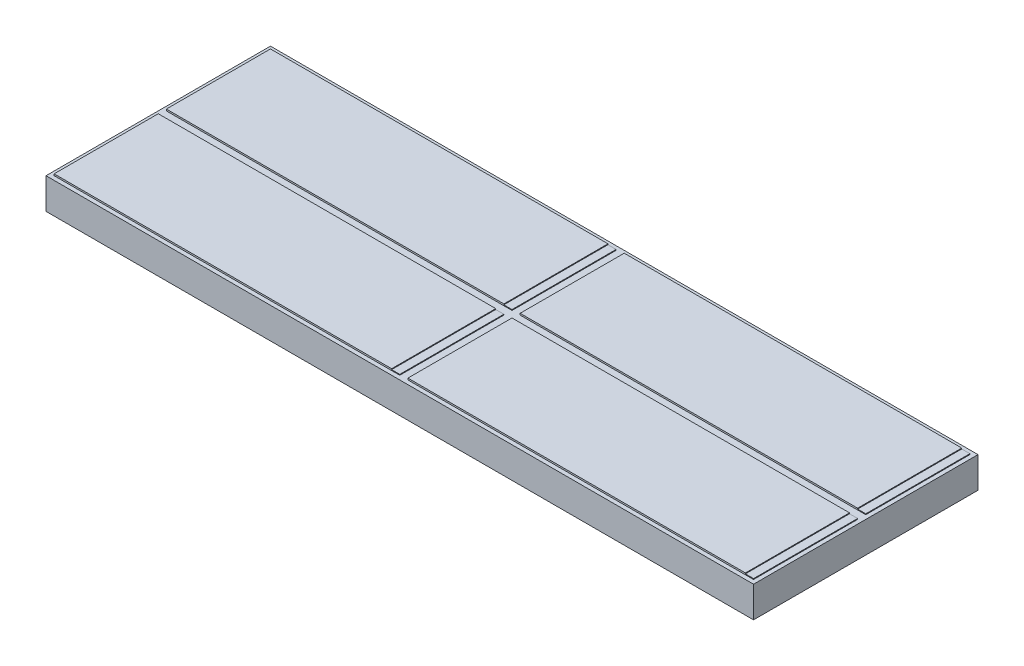
ISO-10303-21;
HEADER;
FILE_DESCRIPTION(('STEP AP214'),'2;1');
FILE_NAME('part.step','',(''),(''),'','','');
FILE_SCHEMA(('AUTOMOTIVE_DESIGN { 1 0 10303 214 1 1 1 1 }'));
ENDSEC;
DATA;
#1=APPLICATION_CONTEXT('core data for automotive mechanical design processes');
#2=APPLICATION_PROTOCOL_DEFINITION('international standard','automotive_design',2000,#1);
#3=PRODUCT_CONTEXT('',#1,'mechanical');
#4=PRODUCT('Part','Part','',(#3));
#5=PRODUCT_RELATED_PRODUCT_CATEGORY('part','',(#4));
#6=PRODUCT_DEFINITION_FORMATION('','',#4);
#7=PRODUCT_DEFINITION_CONTEXT('part definition',#1,'design');
#8=PRODUCT_DEFINITION('design','',#6,#7);
#9=PRODUCT_DEFINITION_SHAPE('','',#8);
#10=(LENGTH_UNIT() NAMED_UNIT(*) SI_UNIT(.MILLI.,.METRE.));
#11=(NAMED_UNIT(*) PLANE_ANGLE_UNIT() SI_UNIT($,.RADIAN.));
#12=(NAMED_UNIT(*) SI_UNIT($,.STERADIAN.) SOLID_ANGLE_UNIT());
#13=UNCERTAINTY_MEASURE_WITH_UNIT(LENGTH_MEASURE(1.E-05),#10,'distance_accuracy_value','');
#14=(GEOMETRIC_REPRESENTATION_CONTEXT(3) GLOBAL_UNCERTAINTY_ASSIGNED_CONTEXT((#13)) GLOBAL_UNIT_ASSIGNED_CONTEXT((#10,
#11,#12)) REPRESENTATION_CONTEXT('',''));
#15=CARTESIAN_POINT('',(0.,0.,0.));
#16=DIRECTION('',(0.,0.,1.));
#17=DIRECTION('',(1.,0.,0.));
#18=AXIS2_PLACEMENT_3D('',#15,#16,#17);
#19=CARTESIAN_POINT('',(31.9521978021978,2.,-9.56923076923076));
#20=DIRECTION('',(-1.,0.,0.));
#21=DIRECTION('',(0.,0.,1.));
#22=AXIS2_PLACEMENT_3D('',#19,#20,#21);
#23=PLANE('',#22);
#24=DIRECTION('',(0.,0.,-1.));
#25=VECTOR('',#24,1.);
#26=CARTESIAN_POINT('',(31.9521978021978,1.95,-3.16923076923076));
#27=LINE('',#26,#25);
#28=CARTESIAN_POINT('',(31.9521978021978,1.95,-3.16923076923076));
#29=VERTEX_POINT('',#28);
#30=CARTESIAN_POINT('',(31.9521978021978,1.95,-9.56923076923076));
#31=VERTEX_POINT('',#30);
#32=EDGE_CURVE('E220',#29,#31,#27,.T.);
#33=ORIENTED_EDGE('',*,*,#32,.F.);
#34=DIRECTION('',(0.,-1.,0.));
#35=VECTOR('',#34,1.);
#36=CARTESIAN_POINT('',(31.9521978021978,2.,-3.16923076923076));
#37=LINE('',#36,#35);
#38=CARTESIAN_POINT('',(31.9521978021978,1.9,-3.16923076923076));
#39=VERTEX_POINT('',#38);
#40=EDGE_CURVE('E406',#29,#39,#37,.T.);
#41=ORIENTED_EDGE('',*,*,#40,.T.);
#42=DIRECTION('',(0.,0.,-1.));
#43=VECTOR('',#42,1.);
#44=CARTESIAN_POINT('',(31.9521978021978,1.9,-9.56923076923076));
#45=LINE('',#44,#43);
#46=CARTESIAN_POINT('',(31.9521978021978,1.9,-9.56923076923076));
#47=VERTEX_POINT('',#46);
#48=EDGE_CURVE('E242',#39,#47,#45,.T.);
#49=ORIENTED_EDGE('',*,*,#48,.T.);
#50=DIRECTION('',(0.,-1.,0.));
#51=VECTOR('',#50,1.);
#52=CARTESIAN_POINT('',(31.9521978021978,2.,-9.56923076923076));
#53=LINE('',#52,#51);
#54=EDGE_CURVE('E236',#31,#47,#53,.T.);
#55=ORIENTED_EDGE('',*,*,#54,.F.);
#56=EDGE_LOOP('',(#33,#41,#49,#55));
#57=FACE_BOUND('',#56,.T.);
#58=ADVANCED_FACE('F34',(#57),#23,.F.);
#59=CARTESIAN_POINT('',(10.2021978021978,2.,-9.56923076923077));
#60=DIRECTION('',(-1.,0.,0.));
#61=DIRECTION('',(0.,0.,1.));
#62=AXIS2_PLACEMENT_3D('',#59,#60,#61);
#63=PLANE('',#62);
#64=DIRECTION('',(0.,0.,-1.));
#65=VECTOR('',#64,1.);
#66=CARTESIAN_POINT('',(10.2021978021978,1.95,-3.16923076923077));
#67=LINE('',#66,#65);
#68=CARTESIAN_POINT('',(10.2021978021978,1.95,-3.16923076923077));
#69=VERTEX_POINT('',#68);
#70=CARTESIAN_POINT('',(10.2021978021978,1.95,-9.56923076923077));
#71=VERTEX_POINT('',#70);
#72=EDGE_CURVE('E436',#69,#71,#67,.T.);
#73=ORIENTED_EDGE('',*,*,#72,.F.);
#74=DIRECTION('',(0.,-1.,0.));
#75=VECTOR('',#74,1.);
#76=CARTESIAN_POINT('',(10.2021978021978,2.,-3.16923076923077));
#77=LINE('',#76,#75);
#78=CARTESIAN_POINT('',(10.2021978021978,1.9,-3.16923076923077));
#79=VERTEX_POINT('',#78);
#80=EDGE_CURVE('E304',#69,#79,#77,.T.);
#81=ORIENTED_EDGE('',*,*,#80,.T.);
#82=DIRECTION('',(0.,0.,-1.));
#83=VECTOR('',#82,1.);
#84=CARTESIAN_POINT('',(10.2021978021978,1.9,-9.56923076923077));
#85=LINE('',#84,#83);
#86=CARTESIAN_POINT('',(10.2021978021978,1.9,-9.56923076923077));
#87=VERTEX_POINT('',#86);
#88=EDGE_CURVE('E295',#79,#87,#85,.T.);
#89=ORIENTED_EDGE('',*,*,#88,.T.);
#90=DIRECTION('',(0.,-1.,0.));
#91=VECTOR('',#90,1.);
#92=CARTESIAN_POINT('',(10.2021978021978,2.,-9.56923076923077));
#93=LINE('',#92,#91);
#94=EDGE_CURVE('E302',#71,#87,#93,.T.);
#95=ORIENTED_EDGE('',*,*,#94,.F.);
#96=EDGE_LOOP('',(#73,#81,#89,#95));
#97=FACE_BOUND('',#96,.T.);
#98=ADVANCED_FACE('F505',(#97),#63,.F.);
#99=CARTESIAN_POINT('',(31.9521978021978,2.,3.73076923076924));
#100=DIRECTION('',(-1.,0.,0.));
#101=DIRECTION('',(0.,0.,1.));
#102=AXIS2_PLACEMENT_3D('',#99,#100,#101);
#103=PLANE('',#102);
#104=DIRECTION('',(0.,0.,-1.));
#105=VECTOR('',#104,1.);
#106=CARTESIAN_POINT('',(31.9521978021978,1.95,3.73076923076924));
#107=LINE('',#106,#105);
#108=CARTESIAN_POINT('',(31.9521978021978,1.95,3.73076923076924));
#109=VERTEX_POINT('',#108);
#110=CARTESIAN_POINT('',(31.9521978021978,1.95,-2.66923076923077));
#111=VERTEX_POINT('',#110);
#112=EDGE_CURVE('E452',#109,#111,#107,.T.);
#113=ORIENTED_EDGE('',*,*,#112,.F.);
#114=DIRECTION('',(0.,-1.,0.));
#115=VECTOR('',#114,1.);
#116=CARTESIAN_POINT('',(31.9521978021978,2.,3.73076923076924));
#117=LINE('',#116,#115);
#118=CARTESIAN_POINT('',(31.9521978021978,1.9,3.73076923076924));
#119=VERTEX_POINT('',#118);
#120=EDGE_CURVE('E378',#109,#119,#117,.T.);
#121=ORIENTED_EDGE('',*,*,#120,.T.);
#122=DIRECTION('',(0.,0.,-1.));
#123=VECTOR('',#122,1.);
#124=CARTESIAN_POINT('',(31.9521978021978,1.9,3.73076923076924));
#125=LINE('',#124,#123);
#126=CARTESIAN_POINT('',(31.9521978021978,1.9,-2.66923076923076));
#127=VERTEX_POINT('',#126);
#128=EDGE_CURVE('E363',#119,#127,#125,.T.);
#129=ORIENTED_EDGE('',*,*,#128,.T.);
#130=DIRECTION('',(0.,-1.,0.));
#131=VECTOR('',#130,1.);
#132=CARTESIAN_POINT('',(31.9521978021978,2.,-2.66923076923076));
#133=LINE('',#132,#131);
#134=EDGE_CURVE('E396',#111,#127,#133,.T.);
#135=ORIENTED_EDGE('',*,*,#134,.F.);
#136=EDGE_LOOP('',(#113,#121,#129,#135));
#137=FACE_BOUND('',#136,.T.);
#138=ADVANCED_FACE('F503',(#137),#103,.F.);
#139=CARTESIAN_POINT('',(10.2021978021978,2.,3.73076923076923));
#140=DIRECTION('',(-1.,0.,0.));
#141=DIRECTION('',(0.,0.,1.));
#142=AXIS2_PLACEMENT_3D('',#139,#140,#141);
#143=PLANE('',#142);
#144=DIRECTION('',(0.,0.,-1.));
#145=VECTOR('',#144,1.);
#146=CARTESIAN_POINT('',(10.2021978021978,1.95,3.73076923076923));
#147=LINE('',#146,#145);
#148=CARTESIAN_POINT('',(10.2021978021978,1.95,3.73076923076923));
#149=VERTEX_POINT('',#148);
#150=CARTESIAN_POINT('',(10.2021978021978,1.95,-2.66923076923077));
#151=VERTEX_POINT('',#150);
#152=EDGE_CURVE('E469',#149,#151,#147,.T.);
#153=ORIENTED_EDGE('',*,*,#152,.F.);
#154=DIRECTION('',(0.,-1.,0.));
#155=VECTOR('',#154,1.);
#156=CARTESIAN_POINT('',(10.2021978021978,2.,3.73076923076923));
#157=LINE('',#156,#155);
#158=CARTESIAN_POINT('',(10.2021978021978,1.9,3.73076923076923));
#159=VERTEX_POINT('',#158);
#160=EDGE_CURVE('E277',#149,#159,#157,.T.);
#161=ORIENTED_EDGE('',*,*,#160,.T.);
#162=DIRECTION('',(0.,0.,-1.));
#163=VECTOR('',#162,1.);
#164=CARTESIAN_POINT('',(10.2021978021978,1.9,3.73076923076923));
#165=LINE('',#164,#163);
#166=CARTESIAN_POINT('',(10.2021978021978,1.9,-2.66923076923077));
#167=VERTEX_POINT('',#166);
#168=EDGE_CURVE('E247',#159,#167,#165,.T.);
#169=ORIENTED_EDGE('',*,*,#168,.T.);
#170=DIRECTION('',(0.,-1.,0.));
#171=VECTOR('',#170,1.);
#172=CARTESIAN_POINT('',(10.2021978021978,2.,-2.66923076923077));
#173=LINE('',#172,#171);
#174=EDGE_CURVE('E275',#151,#167,#173,.T.);
#175=ORIENTED_EDGE('',*,*,#174,.F.);
#176=EDGE_LOOP('',(#153,#161,#169,#175));
#177=FACE_BOUND('',#176,.T.);
#178=ADVANCED_FACE('F355',(#177),#143,.F.);
#179=CARTESIAN_POINT('',(0.,1.9,0.));
#180=DIRECTION('',(0.,-1.,0.));
#181=DIRECTION('',(0.,0.,-1.));
#182=AXIS2_PLACEMENT_3D('',#179,#180,#181);
#183=PLANE('',#182);
#184=ORIENTED_EDGE('',*,*,#48,.F.);
#185=DIRECTION('',(1.,0.,0.));
#186=VECTOR('',#185,1.);
#187=CARTESIAN_POINT('',(31.9521978021978,1.9,-3.16923076923076));
#188=LINE('',#187,#186);
#189=CARTESIAN_POINT('',(10.7021978021978,1.9,-3.16923076923077));
#190=VERTEX_POINT('',#189);
#191=EDGE_CURVE('E401',#190,#39,#188,.T.);
#192=ORIENTED_EDGE('',*,*,#191,.F.);
#193=DIRECTION('',(0.,0.,1.));
#194=VECTOR('',#193,1.);
#195=CARTESIAN_POINT('',(10.7021978021978,1.9,-9.56923076923077));
#196=LINE('',#195,#194);
#197=CARTESIAN_POINT('',(10.7021978021978,1.9,-9.56923076923077));
#198=VERTEX_POINT('',#197);
#199=EDGE_CURVE('E410',#198,#190,#196,.T.);
#200=ORIENTED_EDGE('',*,*,#199,.F.);
#201=DIRECTION('',(-1.,0.,0.));
#202=VECTOR('',#201,1.);
#203=CARTESIAN_POINT('',(31.9521978021978,1.9,-9.56923076923076));
#204=LINE('',#203,#202);
#205=EDGE_CURVE('E408',#47,#198,#204,.T.);
#206=ORIENTED_EDGE('',*,*,#205,.F.);
#207=EDGE_LOOP('',(#184,#192,#200,#206));
#208=FACE_BOUND('',#207,.T.);
#209=DIRECTION('',(0.,0.,1.));
#210=VECTOR('',#209,1.);
#211=CARTESIAN_POINT('',(-11.0478021978022,1.9,-9.56923076923077));
#212=LINE('',#211,#210);
#213=CARTESIAN_POINT('',(-11.0478021978022,1.9,-9.56923076923077));
#214=VERTEX_POINT('',#213);
#215=CARTESIAN_POINT('',(-11.0478021978022,1.9,-3.16923076923077));
#216=VERTEX_POINT('',#215);
#217=EDGE_CURVE('E279',#214,#216,#212,.T.);
#218=ORIENTED_EDGE('',*,*,#217,.F.);
#219=DIRECTION('',(-1.,0.,0.));
#220=VECTOR('',#219,1.);
#221=CARTESIAN_POINT('',(-11.0478021978022,1.9,-9.56923076923077));
#222=LINE('',#221,#220);
#223=EDGE_CURVE('E284',#87,#214,#222,.T.);
#224=ORIENTED_EDGE('',*,*,#223,.F.);
#225=ORIENTED_EDGE('',*,*,#88,.F.);
#226=DIRECTION('',(1.,0.,0.));
#227=VECTOR('',#226,1.);
#228=CARTESIAN_POINT('',(-11.0478021978022,1.9,-3.16923076923077));
#229=LINE('',#228,#227);
#230=EDGE_CURVE('E292',#216,#79,#229,.T.);
#231=ORIENTED_EDGE('',*,*,#230,.F.);
#232=EDGE_LOOP('',(#218,#224,#225,#231));
#233=FACE_BOUND('',#232,.T.);
#234=DIRECTION('',(1.,0.,0.));
#235=VECTOR('',#234,1.);
#236=CARTESIAN_POINT('',(-11.2978021978022,1.9,-9.81923076923077));
#237=LINE('',#236,#235);
#238=CARTESIAN_POINT('',(-11.2978021978022,1.9,-9.81923076923077));
#239=VERTEX_POINT('',#238);
#240=CARTESIAN_POINT('',(32.2021978021978,1.9,-9.81923076923077));
#241=VERTEX_POINT('',#240);
#242=EDGE_CURVE('E310',#239,#241,#237,.T.);
#243=ORIENTED_EDGE('',*,*,#242,.F.);
#244=DIRECTION('',(0.,0.,1.));
#245=VECTOR('',#244,1.);
#246=CARTESIAN_POINT('',(-11.2978021978022,1.9,-9.81923076923077));
#247=LINE('',#246,#245);
#248=CARTESIAN_POINT('',(-11.2978021978022,1.9,3.98076923076923));
#249=VERTEX_POINT('',#248);
#250=EDGE_CURVE('E319',#239,#249,#247,.T.);
#251=ORIENTED_EDGE('',*,*,#250,.T.);
#252=DIRECTION('',(1.,0.,0.));
#253=VECTOR('',#252,1.);
#254=CARTESIAN_POINT('',(-11.2978021978022,1.9,3.98076923076923));
#255=LINE('',#254,#253);
#256=CARTESIAN_POINT('',(32.2021978021978,1.9,3.98076923076923));
#257=VERTEX_POINT('',#256);
#258=EDGE_CURVE('E317',#249,#257,#255,.T.);
#259=ORIENTED_EDGE('',*,*,#258,.T.);
#260=DIRECTION('',(0.,0.,1.));
#261=VECTOR('',#260,1.);
#262=CARTESIAN_POINT('',(32.2021978021978,1.9,-9.81923076923077));
#263=LINE('',#262,#261);
#264=EDGE_CURVE('E313',#241,#257,#263,.T.);
#265=ORIENTED_EDGE('',*,*,#264,.F.);
#266=EDGE_LOOP('',(#243,#251,#259,#265));
#267=FACE_BOUND('',#266,.T.);
#268=DIRECTION('',(1.,0.,0.));
#269=VECTOR('',#268,1.);
#270=CARTESIAN_POINT('',(-11.0478021978022,1.9,3.73076923076923));
#271=LINE('',#270,#269);
#272=CARTESIAN_POINT('',(-11.0478021978022,1.9,3.73076923076923));
#273=VERTEX_POINT('',#272);
#274=EDGE_CURVE('E243',#273,#159,#271,.T.);
#275=ORIENTED_EDGE('',*,*,#274,.F.);
#276=DIRECTION('',(0.,0.,1.));
#277=VECTOR('',#276,1.);
#278=CARTESIAN_POINT('',(-11.0478021978022,1.9,3.73076923076923));
#279=LINE('',#278,#277);
#280=CARTESIAN_POINT('',(-11.0478021978022,1.9,-2.66923076923077));
#281=VERTEX_POINT('',#280);
#282=EDGE_CURVE('E258',#281,#273,#279,.T.);
#283=ORIENTED_EDGE('',*,*,#282,.F.);
#284=DIRECTION('',(-1.,0.,0.));
#285=VECTOR('',#284,1.);
#286=CARTESIAN_POINT('',(-11.0478021978022,1.9,-2.66923076923077));
#287=LINE('',#286,#285);
#288=EDGE_CURVE('E265',#167,#281,#287,.T.);
#289=ORIENTED_EDGE('',*,*,#288,.F.);
#290=ORIENTED_EDGE('',*,*,#168,.F.);
#291=EDGE_LOOP('',(#275,#283,#289,#290));
#292=FACE_BOUND('',#291,.T.);
#293=ORIENTED_EDGE('',*,*,#128,.F.);
#294=DIRECTION('',(1.,0.,0.));
#295=VECTOR('',#294,1.);
#296=CARTESIAN_POINT('',(31.9521978021978,1.9,3.73076923076924));
#297=LINE('',#296,#295);
#298=CARTESIAN_POINT('',(10.7021978021978,1.9,3.73076923076923));
#299=VERTEX_POINT('',#298);
#300=EDGE_CURVE('E365',#299,#119,#297,.T.);
#301=ORIENTED_EDGE('',*,*,#300,.F.);
#302=DIRECTION('',(0.,0.,1.));
#303=VECTOR('',#302,1.);
#304=CARTESIAN_POINT('',(10.7021978021978,1.9,3.73076923076923));
#305=LINE('',#304,#303);
#306=CARTESIAN_POINT('',(10.7021978021978,1.9,-2.66923076923077));
#307=VERTEX_POINT('',#306);
#308=EDGE_CURVE('E383',#307,#299,#305,.T.);
#309=ORIENTED_EDGE('',*,*,#308,.F.);
#310=DIRECTION('',(-1.,0.,0.));
#311=VECTOR('',#310,1.);
#312=CARTESIAN_POINT('',(31.9521978021978,1.9,-2.66923076923076));
#313=LINE('',#312,#311);
#314=EDGE_CURVE('E368',#127,#307,#313,.T.);
#315=ORIENTED_EDGE('',*,*,#314,.F.);
#316=EDGE_LOOP('',(#293,#301,#309,#315));
#317=FACE_BOUND('',#316,.T.);
#318=ADVANCED_FACE('F352',(#208,#233,#267,#292,#317),#183,.F.);
#319=CARTESIAN_POINT('',(-11.2978021978022,1.9,-9.81923076923077));
#320=DIRECTION('',(0.,0.,-1.));
#321=DIRECTION('',(-1.,0.,0.));
#322=AXIS2_PLACEMENT_3D('',#319,#320,#321);
#323=PLANE('',#322);
#324=DIRECTION('',(1.,0.,0.));
#325=VECTOR('',#324,1.);
#326=CARTESIAN_POINT('',(-11.2978021978022,0.,-9.81923076923077));
#327=LINE('',#326,#325);
#328=CARTESIAN_POINT('',(-11.2978021978022,0.,-9.81923076923077));
#329=VERTEX_POINT('',#328);
#330=CARTESIAN_POINT('',(32.2021978021978,0.,-9.81923076923077));
#331=VERTEX_POINT('',#330);
#332=EDGE_CURVE('E309',#329,#331,#327,.T.);
#333=ORIENTED_EDGE('',*,*,#332,.F.);
#334=DIRECTION('',(0.,-1.,0.));
#335=VECTOR('',#334,1.);
#336=CARTESIAN_POINT('',(-11.2978021978022,1.9,-9.81923076923077));
#337=LINE('',#336,#335);
#338=EDGE_CURVE('E11',#239,#329,#337,.T.);
#339=ORIENTED_EDGE('',*,*,#338,.F.);
#340=ORIENTED_EDGE('',*,*,#242,.T.);
#341=DIRECTION('',(0.,-1.,0.));
#342=VECTOR('',#341,1.);
#343=CARTESIAN_POINT('',(32.2021978021978,1.9,-9.81923076923077));
#344=LINE('',#343,#342);
#345=EDGE_CURVE('E38',#241,#331,#344,.T.);
#346=ORIENTED_EDGE('',*,*,#345,.T.);
#347=EDGE_LOOP('',(#333,#339,#340,#346));
#348=FACE_BOUND('',#347,.T.);
#349=ADVANCED_FACE('F36',(#348),#323,.T.);
#350=CARTESIAN_POINT('',(-11.2978021978022,1.9,-9.81923076923077));
#351=DIRECTION('',(1.,0.,0.));
#352=DIRECTION('',(0.,0.,-1.));
#353=AXIS2_PLACEMENT_3D('',#350,#351,#352);
#354=PLANE('',#353);
#355=DIRECTION('',(0.,0.,1.));
#356=VECTOR('',#355,1.);
#357=CARTESIAN_POINT('',(-11.2978021978022,0.,-9.81923076923077));
#358=LINE('',#357,#356);
#359=CARTESIAN_POINT('',(-11.2978021978022,0.,3.98076923076923));
#360=VERTEX_POINT('',#359);
#361=EDGE_CURVE('E314',#329,#360,#358,.T.);
#362=ORIENTED_EDGE('',*,*,#361,.T.);
#363=DIRECTION('',(0.,-1.,0.));
#364=VECTOR('',#363,1.);
#365=CARTESIAN_POINT('',(-11.2978021978022,1.9,3.98076923076923));
#366=LINE('',#365,#364);
#367=EDGE_CURVE('E43',#249,#360,#366,.T.);
#368=ORIENTED_EDGE('',*,*,#367,.F.);
#369=ORIENTED_EDGE('',*,*,#250,.F.);
#370=ORIENTED_EDGE('',*,*,#338,.T.);
#371=EDGE_LOOP('',(#362,#368,#369,#370));
#372=FACE_BOUND('',#371,.T.);
#373=ADVANCED_FACE('F346',(#372),#354,.F.);
#374=CARTESIAN_POINT('',(-11.2978021978022,1.9,3.98076923076923));
#375=DIRECTION('',(0.,0.,-1.));
#376=DIRECTION('',(-1.,0.,0.));
#377=AXIS2_PLACEMENT_3D('',#374,#375,#376);
#378=PLANE('',#377);
#379=DIRECTION('',(1.,0.,0.));
#380=VECTOR('',#379,1.);
#381=CARTESIAN_POINT('',(-11.2978021978022,0.,3.98076923076923));
#382=LINE('',#381,#380);
#383=CARTESIAN_POINT('',(32.2021978021978,0.,3.98076923076923));
#384=VERTEX_POINT('',#383);
#385=EDGE_CURVE('E326',#360,#384,#382,.T.);
#386=ORIENTED_EDGE('',*,*,#385,.T.);
#387=DIRECTION('',(0.,-1.,0.));
#388=VECTOR('',#387,1.);
#389=CARTESIAN_POINT('',(32.2021978021978,1.9,3.98076923076923));
#390=LINE('',#389,#388);
#391=EDGE_CURVE('E331',#257,#384,#390,.T.);
#392=ORIENTED_EDGE('',*,*,#391,.F.);
#393=ORIENTED_EDGE('',*,*,#258,.F.);
#394=ORIENTED_EDGE('',*,*,#367,.T.);
#395=EDGE_LOOP('',(#386,#392,#393,#394));
#396=FACE_BOUND('',#395,.T.);
#397=ADVANCED_FACE('F350',(#396),#378,.F.);
#398=CARTESIAN_POINT('',(32.2021978021978,1.9,-9.81923076923077));
#399=DIRECTION('',(1.,0.,0.));
#400=DIRECTION('',(0.,0.,-1.));
#401=AXIS2_PLACEMENT_3D('',#398,#399,#400);
#402=PLANE('',#401);
#403=DIRECTION('',(0.,0.,1.));
#404=VECTOR('',#403,1.);
#405=CARTESIAN_POINT('',(32.2021978021978,0.,-9.81923076923077));
#406=LINE('',#405,#404);
#407=EDGE_CURVE('E323',#331,#384,#406,.T.);
#408=ORIENTED_EDGE('',*,*,#407,.F.);
#409=ORIENTED_EDGE('',*,*,#345,.F.);
#410=ORIENTED_EDGE('',*,*,#264,.T.);
#411=ORIENTED_EDGE('',*,*,#391,.T.);
#412=EDGE_LOOP('',(#408,#409,#410,#411));
#413=FACE_BOUND('',#412,.T.);
#414=ADVANCED_FACE('F339',(#413),#402,.T.);
#415=CARTESIAN_POINT('',(0.,0.,0.));
#416=DIRECTION('',(0.,-1.,0.));
#417=DIRECTION('',(0.,0.,-1.));
#418=AXIS2_PLACEMENT_3D('',#415,#416,#417);
#419=PLANE('',#418);
#420=ORIENTED_EDGE('',*,*,#332,.T.);
#421=ORIENTED_EDGE('',*,*,#407,.T.);
#422=ORIENTED_EDGE('',*,*,#385,.F.);
#423=ORIENTED_EDGE('',*,*,#361,.F.);
#424=EDGE_LOOP('',(#420,#421,#422,#423));
#425=FACE_BOUND('',#424,.T.);
#426=ADVANCED_FACE('F343',(#425),#419,.T.);
#427=CARTESIAN_POINT('',(-11.0478021978022,2.,-9.56923076923077));
#428=DIRECTION('',(1.,0.,0.));
#429=DIRECTION('',(0.,0.,-1.));
#430=AXIS2_PLACEMENT_3D('',#427,#428,#429);
#431=PLANE('',#430);
#432=ORIENTED_EDGE('',*,*,#217,.T.);
#433=DIRECTION('',(0.,-1.,0.));
#434=VECTOR('',#433,1.);
#435=CARTESIAN_POINT('',(-11.0478021978022,2.,-3.16923076923077));
#436=LINE('',#435,#434);
#437=CARTESIAN_POINT('',(-11.0478021978022,2.,-3.16923076923077));
#438=VERTEX_POINT('',#437);
#439=EDGE_CURVE('E306',#438,#216,#436,.T.);
#440=ORIENTED_EDGE('',*,*,#439,.F.);
#441=DIRECTION('',(0.,0.,1.));
#442=VECTOR('',#441,1.);
#443=CARTESIAN_POINT('',(-11.0478021978022,2.,-9.56923076923077));
#444=LINE('',#443,#442);
#445=CARTESIAN_POINT('',(-11.0478021978022,2.,-9.56923076923077));
#446=VERTEX_POINT('',#445);
#447=EDGE_CURVE('E280',#446,#438,#444,.T.);
#448=ORIENTED_EDGE('',*,*,#447,.F.);
#449=DIRECTION('',(0.,-1.,0.));
#450=VECTOR('',#449,1.);
#451=CARTESIAN_POINT('',(-11.0478021978022,2.,-9.56923076923077));
#452=LINE('',#451,#450);
#453=EDGE_CURVE('E289',#446,#214,#452,.T.);
#454=ORIENTED_EDGE('',*,*,#453,.T.);
#455=EDGE_LOOP('',(#432,#440,#448,#454));
#456=FACE_BOUND('',#455,.T.);
#457=ADVANCED_FACE('F551',(#456),#431,.F.);
#458=CARTESIAN_POINT('',(-11.0478021978022,2.,-3.16923076923077));
#459=DIRECTION('',(0.,0.,-1.));
#460=DIRECTION('',(-1.,0.,0.));
#461=AXIS2_PLACEMENT_3D('',#458,#459,#460);
#462=PLANE('',#461);
#463=DIRECTION('',(1.,0.,0.));
#464=VECTOR('',#463,1.);
#465=CARTESIAN_POINT('',(10.2021978021978,1.95,-3.16923076923077));
#466=LINE('',#465,#464);
#467=CARTESIAN_POINT('',(9.7021978021978,1.95,-3.16923076923077));
#468=VERTEX_POINT('',#467);
#469=EDGE_CURVE('E444',#468,#69,#466,.T.);
#470=ORIENTED_EDGE('',*,*,#469,.F.);
#471=DIRECTION('',(0.,1.,0.));
#472=VECTOR('',#471,1.);
#473=CARTESIAN_POINT('',(9.7021978021978,1.95,-3.16923076923077));
#474=LINE('',#473,#472);
#475=CARTESIAN_POINT('',(9.7021978021978,2.,-3.16923076923077));
#476=VERTEX_POINT('',#475);
#477=EDGE_CURVE('E447',#468,#476,#474,.T.);
#478=ORIENTED_EDGE('',*,*,#477,.T.);
#479=DIRECTION('',(1.,0.,0.));
#480=VECTOR('',#479,1.);
#481=CARTESIAN_POINT('',(-11.0478021978022,2.,-3.16923076923077));
#482=LINE('',#481,#480);
#483=EDGE_CURVE('E283',#438,#476,#482,.T.);
#484=ORIENTED_EDGE('',*,*,#483,.F.);
#485=ORIENTED_EDGE('',*,*,#439,.T.);
#486=ORIENTED_EDGE('',*,*,#230,.T.);
#487=ORIENTED_EDGE('',*,*,#80,.F.);
#488=EDGE_LOOP('',(#470,#478,#484,#485,#486,#487));
#489=FACE_BOUND('',#488,.T.);
#490=ADVANCED_FACE('F546',(#489),#462,.F.);
#491=CARTESIAN_POINT('',(-11.0478021978022,2.,-9.56923076923077));
#492=DIRECTION('',(0.,0.,1.));
#493=DIRECTION('',(1.,0.,0.));
#494=AXIS2_PLACEMENT_3D('',#491,#492,#493);
#495=PLANE('',#494);
#496=DIRECTION('',(-1.,0.,0.));
#497=VECTOR('',#496,1.);
#498=CARTESIAN_POINT('',(-11.0478021978022,2.,-9.56923076923077));
#499=LINE('',#498,#497);
#500=CARTESIAN_POINT('',(9.7021978021978,2.,-9.56923076923077));
#501=VERTEX_POINT('',#500);
#502=EDGE_CURVE('E287',#501,#446,#499,.T.);
#503=ORIENTED_EDGE('',*,*,#502,.F.);
#504=DIRECTION('',(0.,1.,0.));
#505=VECTOR('',#504,1.);
#506=CARTESIAN_POINT('',(9.7021978021978,1.95,-9.56923076923077));
#507=LINE('',#506,#505);
#508=CARTESIAN_POINT('',(9.7021978021978,1.95,-9.56923076923077));
#509=VERTEX_POINT('',#508);
#510=EDGE_CURVE('E59',#509,#501,#507,.T.);
#511=ORIENTED_EDGE('',*,*,#510,.F.);
#512=DIRECTION('',(-1.,0.,0.));
#513=VECTOR('',#512,1.);
#514=CARTESIAN_POINT('',(10.2021978021978,1.95,-9.56923076923077));
#515=LINE('',#514,#513);
#516=EDGE_CURVE('E438',#71,#509,#515,.T.);
#517=ORIENTED_EDGE('',*,*,#516,.F.);
#518=ORIENTED_EDGE('',*,*,#94,.T.);
#519=ORIENTED_EDGE('',*,*,#223,.T.);
#520=ORIENTED_EDGE('',*,*,#453,.F.);
#521=EDGE_LOOP('',(#503,#511,#517,#518,#519,#520));
#522=FACE_BOUND('',#521,.T.);
#523=ADVANCED_FACE('F543',(#522),#495,.F.);
#524=CARTESIAN_POINT('',(0.,2.,0.));
#525=DIRECTION('',(0.,1.,0.));
#526=DIRECTION('',(0.,0.,1.));
#527=AXIS2_PLACEMENT_3D('',#524,#525,#526);
#528=PLANE('',#527);
#529=DIRECTION('',(0.,0.,1.));
#530=VECTOR('',#529,1.);
#531=CARTESIAN_POINT('',(9.7021978021978,2.,-3.16923076923077));
#532=LINE('',#531,#530);
#533=EDGE_CURVE('E434',#501,#476,#532,.T.);
#534=ORIENTED_EDGE('',*,*,#533,.F.);
#535=ORIENTED_EDGE('',*,*,#502,.T.);
#536=ORIENTED_EDGE('',*,*,#447,.T.);
#537=ORIENTED_EDGE('',*,*,#483,.T.);
#538=EDGE_LOOP('',(#534,#535,#536,#537));
#539=FACE_BOUND('',#538,.T.);
#540=ADVANCED_FACE('F539',(#539),#528,.T.);
#541=CARTESIAN_POINT('',(-11.0478021978022,2.,3.73076923076923));
#542=DIRECTION('',(0.,0.,-1.));
#543=DIRECTION('',(-1.,0.,0.));
#544=AXIS2_PLACEMENT_3D('',#541,#542,#543);
#545=PLANE('',#544);
#546=DIRECTION('',(1.,0.,0.));
#547=VECTOR('',#546,1.);
#548=CARTESIAN_POINT('',(10.2021978021978,1.95,3.73076923076923));
#549=LINE('',#548,#547);
#550=CARTESIAN_POINT('',(9.7021978021978,1.95,3.73076923076923));
#551=VERTEX_POINT('',#550);
#552=EDGE_CURVE('E477',#551,#149,#549,.T.);
#553=ORIENTED_EDGE('',*,*,#552,.F.);
#554=DIRECTION('',(0.,1.,0.));
#555=VECTOR('',#554,1.);
#556=CARTESIAN_POINT('',(9.7021978021978,1.95,3.73076923076923));
#557=LINE('',#556,#555);
#558=CARTESIAN_POINT('',(9.7021978021978,2.,3.73076923076923));
#559=VERTEX_POINT('',#558);
#560=EDGE_CURVE('E371',#551,#559,#557,.T.);
#561=ORIENTED_EDGE('',*,*,#560,.T.);
#562=DIRECTION('',(1.,0.,0.));
#563=VECTOR('',#562,1.);
#564=CARTESIAN_POINT('',(-11.0478021978022,2.,3.73076923076923));
#565=LINE('',#564,#563);
#566=CARTESIAN_POINT('',(-11.0478021978022,2.,3.73076923076923));
#567=VERTEX_POINT('',#566);
#568=EDGE_CURVE('E254',#567,#559,#565,.T.);
#569=ORIENTED_EDGE('',*,*,#568,.F.);
#570=DIRECTION('',(0.,-1.,0.));
#571=VECTOR('',#570,1.);
#572=CARTESIAN_POINT('',(-11.0478021978022,2.,3.73076923076923));
#573=LINE('',#572,#571);
#574=EDGE_CURVE('E261',#567,#273,#573,.T.);
#575=ORIENTED_EDGE('',*,*,#574,.T.);
#576=ORIENTED_EDGE('',*,*,#274,.T.);
#577=ORIENTED_EDGE('',*,*,#160,.F.);
#578=EDGE_LOOP('',(#553,#561,#569,#575,#576,#577));
#579=FACE_BOUND('',#578,.T.);
#580=ADVANCED_FACE('F534',(#579),#545,.F.);
#581=CARTESIAN_POINT('',(-11.0478021978022,2.,-2.66923076923077));
#582=DIRECTION('',(0.,0.,1.));
#583=DIRECTION('',(1.,0.,0.));
#584=AXIS2_PLACEMENT_3D('',#581,#582,#583);
#585=PLANE('',#584);
#586=DIRECTION('',(-1.,0.,0.));
#587=VECTOR('',#586,1.);
#588=CARTESIAN_POINT('',(-11.0478021978022,2.,-2.66923076923077));
#589=LINE('',#588,#587);
#590=CARTESIAN_POINT('',(9.7021978021978,2.,-2.66923076923077));
#591=VERTEX_POINT('',#590);
#592=CARTESIAN_POINT('',(-11.0478021978022,2.,-2.66923076923077));
#593=VERTEX_POINT('',#592);
#594=EDGE_CURVE('E257',#591,#593,#589,.T.);
#595=ORIENTED_EDGE('',*,*,#594,.F.);
#596=DIRECTION('',(0.,1.,0.));
#597=VECTOR('',#596,1.);
#598=CARTESIAN_POINT('',(9.7021978021978,1.95,-2.66923076923077));
#599=LINE('',#598,#597);
#600=CARTESIAN_POINT('',(9.7021978021978,1.95,-2.66923076923077));
#601=VERTEX_POINT('',#600);
#602=EDGE_CURVE('E479',#601,#591,#599,.T.);
#603=ORIENTED_EDGE('',*,*,#602,.F.);
#604=DIRECTION('',(-1.,0.,0.));
#605=VECTOR('',#604,1.);
#606=CARTESIAN_POINT('',(10.2021978021978,1.95,-2.66923076923077));
#607=LINE('',#606,#605);
#608=EDGE_CURVE('E471',#151,#601,#607,.T.);
#609=ORIENTED_EDGE('',*,*,#608,.F.);
#610=ORIENTED_EDGE('',*,*,#174,.T.);
#611=ORIENTED_EDGE('',*,*,#288,.T.);
#612=DIRECTION('',(0.,-1.,0.));
#613=VECTOR('',#612,1.);
#614=CARTESIAN_POINT('',(-11.0478021978022,2.,-2.66923076923077));
#615=LINE('',#614,#613);
#616=EDGE_CURVE('E272',#593,#281,#615,.T.);
#617=ORIENTED_EDGE('',*,*,#616,.F.);
#618=EDGE_LOOP('',(#595,#603,#609,#610,#611,#617));
#619=FACE_BOUND('',#618,.T.);
#620=ADVANCED_FACE('F531',(#619),#585,.F.);
#621=CARTESIAN_POINT('',(-11.0478021978022,2.,3.73076923076923));
#622=DIRECTION('',(1.,0.,0.));
#623=DIRECTION('',(0.,0.,-1.));
#624=AXIS2_PLACEMENT_3D('',#621,#622,#623);
#625=PLANE('',#624);
#626=ORIENTED_EDGE('',*,*,#282,.T.);
#627=ORIENTED_EDGE('',*,*,#574,.F.);
#628=DIRECTION('',(0.,0.,1.));
#629=VECTOR('',#628,1.);
#630=CARTESIAN_POINT('',(-11.0478021978022,2.,3.73076923076923));
#631=LINE('',#630,#629);
#632=EDGE_CURVE('E260',#593,#567,#631,.T.);
#633=ORIENTED_EDGE('',*,*,#632,.F.);
#634=ORIENTED_EDGE('',*,*,#616,.T.);
#635=EDGE_LOOP('',(#626,#627,#633,#634));
#636=FACE_BOUND('',#635,.T.);
#637=ADVANCED_FACE('F527',(#636),#625,.F.);
#638=CARTESIAN_POINT('',(0.,2.,0.));
#639=DIRECTION('',(0.,1.,0.));
#640=DIRECTION('',(0.,0.,1.));
#641=AXIS2_PLACEMENT_3D('',#638,#639,#640);
#642=PLANE('',#641);
#643=DIRECTION('',(0.,0.,1.));
#644=VECTOR('',#643,1.);
#645=CARTESIAN_POINT('',(9.7021978021978,2.,3.73076923076923));
#646=LINE('',#645,#644);
#647=EDGE_CURVE('E467',#591,#559,#646,.T.);
#648=ORIENTED_EDGE('',*,*,#647,.F.);
#649=ORIENTED_EDGE('',*,*,#594,.T.);
#650=ORIENTED_EDGE('',*,*,#632,.T.);
#651=ORIENTED_EDGE('',*,*,#568,.T.);
#652=EDGE_LOOP('',(#648,#649,#650,#651));
#653=FACE_BOUND('',#652,.T.);
#654=ADVANCED_FACE('F524',(#653),#642,.T.);
#655=CARTESIAN_POINT('',(31.9521978021978,2.,-9.56923076923076));
#656=DIRECTION('',(0.,0.,1.));
#657=DIRECTION('',(1.,0.,0.));
#658=AXIS2_PLACEMENT_3D('',#655,#656,#657);
#659=PLANE('',#658);
#660=DIRECTION('',(-1.,0.,0.));
#661=VECTOR('',#660,1.);
#662=CARTESIAN_POINT('',(31.9521978021978,2.,-9.56923076923076));
#663=LINE('',#662,#661);
#664=CARTESIAN_POINT('',(31.4521978021978,2.,-9.56923076923076));
#665=VERTEX_POINT('',#664);
#666=CARTESIAN_POINT('',(10.7021978021978,2.,-9.56923076923077));
#667=VERTEX_POINT('',#666);
#668=EDGE_CURVE('E398',#665,#667,#663,.T.);
#669=ORIENTED_EDGE('',*,*,#668,.F.);
#670=DIRECTION('',(0.,1.,0.));
#671=VECTOR('',#670,1.);
#672=CARTESIAN_POINT('',(31.4521978021978,1.95,-9.56923076923076));
#673=LINE('',#672,#671);
#674=CARTESIAN_POINT('',(31.4521978021978,1.95,-9.56923076923076));
#675=VERTEX_POINT('',#674);
#676=EDGE_CURVE('E51',#675,#665,#673,.T.);
#677=ORIENTED_EDGE('',*,*,#676,.F.);
#678=DIRECTION('',(-1.,0.,0.));
#679=VECTOR('',#678,1.);
#680=CARTESIAN_POINT('',(31.9521978021978,1.95,-9.56923076923076));
#681=LINE('',#680,#679);
#682=EDGE_CURVE('E224',#31,#675,#681,.T.);
#683=ORIENTED_EDGE('',*,*,#682,.F.);
#684=ORIENTED_EDGE('',*,*,#54,.T.);
#685=ORIENTED_EDGE('',*,*,#205,.T.);
#686=DIRECTION('',(0.,-1.,0.));
#687=VECTOR('',#686,1.);
#688=CARTESIAN_POINT('',(10.7021978021978,2.,-9.56923076923077));
#689=LINE('',#688,#687);
#690=EDGE_CURVE('E244',#667,#198,#689,.T.);
#691=ORIENTED_EDGE('',*,*,#690,.F.);
#692=EDGE_LOOP('',(#669,#677,#683,#684,#685,#691));
#693=FACE_BOUND('',#692,.T.);
#694=ADVANCED_FACE('F234',(#693),#659,.F.);
#695=CARTESIAN_POINT('',(10.7021978021978,2.,-9.56923076923077));
#696=DIRECTION('',(1.,0.,0.));
#697=DIRECTION('',(0.,0.,-1.));
#698=AXIS2_PLACEMENT_3D('',#695,#696,#697);
#699=PLANE('',#698);
#700=ORIENTED_EDGE('',*,*,#199,.T.);
#701=DIRECTION('',(0.,-1.,0.));
#702=VECTOR('',#701,1.);
#703=CARTESIAN_POINT('',(10.7021978021978,2.,-3.16923076923077));
#704=LINE('',#703,#702);
#705=CARTESIAN_POINT('',(10.7021978021978,2.,-3.16923076923077));
#706=VERTEX_POINT('',#705);
#707=EDGE_CURVE('E250',#706,#190,#704,.T.);
#708=ORIENTED_EDGE('',*,*,#707,.F.);
#709=DIRECTION('',(0.,0.,1.));
#710=VECTOR('',#709,1.);
#711=CARTESIAN_POINT('',(10.7021978021978,2.,-9.56923076923077));
#712=LINE('',#711,#710);
#713=EDGE_CURVE('E400',#667,#706,#712,.T.);
#714=ORIENTED_EDGE('',*,*,#713,.F.);
#715=ORIENTED_EDGE('',*,*,#690,.T.);
#716=EDGE_LOOP('',(#700,#708,#714,#715));
#717=FACE_BOUND('',#716,.T.);
#718=ADVANCED_FACE('F423',(#717),#699,.F.);
#719=CARTESIAN_POINT('',(31.9521978021978,2.,-3.16923076923076));
#720=DIRECTION('',(0.,0.,-1.));
#721=DIRECTION('',(-1.,0.,0.));
#722=AXIS2_PLACEMENT_3D('',#719,#720,#721);
#723=PLANE('',#722);
#724=DIRECTION('',(1.,0.,0.));
#725=VECTOR('',#724,1.);
#726=CARTESIAN_POINT('',(31.9521978021978,1.95,-3.16923076923076));
#727=LINE('',#726,#725);
#728=CARTESIAN_POINT('',(31.4521978021978,1.95,-3.16923076923076));
#729=VERTEX_POINT('',#728);
#730=EDGE_CURVE('E226',#729,#29,#727,.T.);
#731=ORIENTED_EDGE('',*,*,#730,.F.);
#732=DIRECTION('',(0.,1.,0.));
#733=VECTOR('',#732,1.);
#734=CARTESIAN_POINT('',(31.4521978021978,1.95,-3.16923076923076));
#735=LINE('',#734,#733);
#736=CARTESIAN_POINT('',(31.4521978021978,2.,-3.16923076923076));
#737=VERTEX_POINT('',#736);
#738=EDGE_CURVE('E432',#729,#737,#735,.T.);
#739=ORIENTED_EDGE('',*,*,#738,.T.);
#740=DIRECTION('',(1.,0.,0.));
#741=VECTOR('',#740,1.);
#742=CARTESIAN_POINT('',(31.9521978021978,2.,-3.16923076923076));
#743=LINE('',#742,#741);
#744=EDGE_CURVE('E403',#706,#737,#743,.T.);
#745=ORIENTED_EDGE('',*,*,#744,.F.);
#746=ORIENTED_EDGE('',*,*,#707,.T.);
#747=ORIENTED_EDGE('',*,*,#191,.T.);
#748=ORIENTED_EDGE('',*,*,#40,.F.);
#749=EDGE_LOOP('',(#731,#739,#745,#746,#747,#748));
#750=FACE_BOUND('',#749,.T.);
#751=ADVANCED_FACE('F419',(#750),#723,.F.);
#752=CARTESIAN_POINT('',(0.,2.,0.));
#753=DIRECTION('',(0.,-1.,0.));
#754=DIRECTION('',(0.,0.,-1.));
#755=AXIS2_PLACEMENT_3D('',#752,#753,#754);
#756=PLANE('',#755);
#757=ORIENTED_EDGE('',*,*,#744,.T.);
#758=DIRECTION('',(0.,0.,1.));
#759=VECTOR('',#758,1.);
#760=CARTESIAN_POINT('',(31.4521978021978,2.,-3.16923076923076));
#761=LINE('',#760,#759);
#762=EDGE_CURVE('E230',#665,#737,#761,.T.);
#763=ORIENTED_EDGE('',*,*,#762,.F.);
#764=ORIENTED_EDGE('',*,*,#668,.T.);
#765=ORIENTED_EDGE('',*,*,#713,.T.);
#766=EDGE_LOOP('',(#757,#763,#764,#765));
#767=FACE_BOUND('',#766,.T.);
#768=ADVANCED_FACE('F427',(#767),#756,.F.);
#769=CARTESIAN_POINT('',(31.9521978021978,2.,-2.66923076923076));
#770=DIRECTION('',(0.,0.,1.));
#771=DIRECTION('',(1.,0.,0.));
#772=AXIS2_PLACEMENT_3D('',#769,#770,#771);
#773=PLANE('',#772);
#774=DIRECTION('',(-1.,0.,0.));
#775=VECTOR('',#774,1.);
#776=CARTESIAN_POINT('',(31.9521978021978,2.,-2.66923076923076));
#777=LINE('',#776,#775);
#778=CARTESIAN_POINT('',(31.4521978021978,2.,-2.66923076923076));
#779=VERTEX_POINT('',#778);
#780=CARTESIAN_POINT('',(10.7021978021978,2.,-2.66923076923077));
#781=VERTEX_POINT('',#780);
#782=EDGE_CURVE('E382',#779,#781,#777,.T.);
#783=ORIENTED_EDGE('',*,*,#782,.F.);
#784=DIRECTION('',(0.,1.,0.));
#785=VECTOR('',#784,1.);
#786=CARTESIAN_POINT('',(31.4521978021978,1.95,-2.66923076923077));
#787=LINE('',#786,#785);
#788=CARTESIAN_POINT('',(31.4521978021978,1.95,-2.66923076923077));
#789=VERTEX_POINT('',#788);
#790=EDGE_CURVE('E462',#789,#779,#787,.T.);
#791=ORIENTED_EDGE('',*,*,#790,.F.);
#792=DIRECTION('',(-1.,0.,0.));
#793=VECTOR('',#792,1.);
#794=CARTESIAN_POINT('',(31.9521978021978,1.95,-2.66923076923077));
#795=LINE('',#794,#793);
#796=EDGE_CURVE('E454',#111,#789,#795,.T.);
#797=ORIENTED_EDGE('',*,*,#796,.F.);
#798=ORIENTED_EDGE('',*,*,#134,.T.);
#799=ORIENTED_EDGE('',*,*,#314,.T.);
#800=DIRECTION('',(0.,-1.,0.));
#801=VECTOR('',#800,1.);
#802=CARTESIAN_POINT('',(10.7021978021978,2.,-2.66923076923077));
#803=LINE('',#802,#801);
#804=EDGE_CURVE('E393',#781,#307,#803,.T.);
#805=ORIENTED_EDGE('',*,*,#804,.F.);
#806=EDGE_LOOP('',(#783,#791,#797,#798,#799,#805));
#807=FACE_BOUND('',#806,.T.);
#808=ADVANCED_FACE('F489',(#807),#773,.F.);
#809=CARTESIAN_POINT('',(10.7021978021978,2.,3.73076923076923));
#810=DIRECTION('',(1.,0.,0.));
#811=DIRECTION('',(0.,0.,-1.));
#812=AXIS2_PLACEMENT_3D('',#809,#810,#811);
#813=PLANE('',#812);
#814=ORIENTED_EDGE('',*,*,#308,.T.);
#815=DIRECTION('',(0.,-1.,0.));
#816=VECTOR('',#815,1.);
#817=CARTESIAN_POINT('',(10.7021978021978,2.,3.73076923076923));
#818=LINE('',#817,#816);
#819=CARTESIAN_POINT('',(10.7021978021978,2.,3.73076923076923));
#820=VERTEX_POINT('',#819);
#821=EDGE_CURVE('E381',#820,#299,#818,.T.);
#822=ORIENTED_EDGE('',*,*,#821,.F.);
#823=DIRECTION('',(0.,0.,1.));
#824=VECTOR('',#823,1.);
#825=CARTESIAN_POINT('',(10.7021978021978,2.,3.73076923076923));
#826=LINE('',#825,#824);
#827=EDGE_CURVE('E385',#781,#820,#826,.T.);
#828=ORIENTED_EDGE('',*,*,#827,.F.);
#829=ORIENTED_EDGE('',*,*,#804,.T.);
#830=EDGE_LOOP('',(#814,#822,#828,#829));
#831=FACE_BOUND('',#830,.T.);
#832=ADVANCED_FACE('F493',(#831),#813,.F.);
#833=CARTESIAN_POINT('',(31.9521978021978,2.,3.73076923076924));
#834=DIRECTION('',(0.,0.,-1.));
#835=DIRECTION('',(-1.,0.,0.));
#836=AXIS2_PLACEMENT_3D('',#833,#834,#835);
#837=PLANE('',#836);
#838=DIRECTION('',(1.,0.,0.));
#839=VECTOR('',#838,1.);
#840=CARTESIAN_POINT('',(31.9521978021978,1.95,3.73076923076924));
#841=LINE('',#840,#839);
#842=CARTESIAN_POINT('',(31.4521978021978,1.95,3.73076923076924));
#843=VERTEX_POINT('',#842);
#844=EDGE_CURVE('E460',#843,#109,#841,.T.);
#845=ORIENTED_EDGE('',*,*,#844,.F.);
#846=DIRECTION('',(0.,1.,0.));
#847=VECTOR('',#846,1.);
#848=CARTESIAN_POINT('',(31.4521978021978,1.95,3.73076923076924));
#849=LINE('',#848,#847);
#850=CARTESIAN_POINT('',(31.4521978021978,2.,3.73076923076924));
#851=VERTEX_POINT('',#850);
#852=EDGE_CURVE('E464',#843,#851,#849,.T.);
#853=ORIENTED_EDGE('',*,*,#852,.T.);
#854=DIRECTION('',(1.,0.,0.));
#855=VECTOR('',#854,1.);
#856=CARTESIAN_POINT('',(31.9521978021978,2.,3.73076923076924));
#857=LINE('',#856,#855);
#858=EDGE_CURVE('E391',#820,#851,#857,.T.);
#859=ORIENTED_EDGE('',*,*,#858,.F.);
#860=ORIENTED_EDGE('',*,*,#821,.T.);
#861=ORIENTED_EDGE('',*,*,#300,.T.);
#862=ORIENTED_EDGE('',*,*,#120,.F.);
#863=EDGE_LOOP('',(#845,#853,#859,#860,#861,#862));
#864=FACE_BOUND('',#863,.T.);
#865=ADVANCED_FACE('F377',(#864),#837,.F.);
#866=CARTESIAN_POINT('',(0.,2.,0.));
#867=DIRECTION('',(0.,1.,0.));
#868=DIRECTION('',(0.,0.,1.));
#869=AXIS2_PLACEMENT_3D('',#866,#867,#868);
#870=PLANE('',#869);
#871=DIRECTION('',(0.,0.,1.));
#872=VECTOR('',#871,1.);
#873=CARTESIAN_POINT('',(31.4521978021978,2.,3.73076923076924));
#874=LINE('',#873,#872);
#875=EDGE_CURVE('E450',#779,#851,#874,.T.);
#876=ORIENTED_EDGE('',*,*,#875,.F.);
#877=ORIENTED_EDGE('',*,*,#782,.T.);
#878=ORIENTED_EDGE('',*,*,#827,.T.);
#879=ORIENTED_EDGE('',*,*,#858,.T.);
#880=EDGE_LOOP('',(#876,#877,#878,#879));
#881=FACE_BOUND('',#880,.T.);
#882=ADVANCED_FACE('F496',(#881),#870,.T.);
#883=CARTESIAN_POINT('',(9.7021978021978,1.95,3.73076923076923));
#884=DIRECTION('',(-1.,0.,0.));
#885=DIRECTION('',(0.,0.,1.));
#886=AXIS2_PLACEMENT_3D('',#883,#884,#885);
#887=PLANE('',#886);
#888=ORIENTED_EDGE('',*,*,#647,.T.);
#889=ORIENTED_EDGE('',*,*,#560,.F.);
#890=DIRECTION('',(0.,0.,1.));
#891=VECTOR('',#890,1.);
#892=CARTESIAN_POINT('',(9.7021978021978,1.95,3.73076923076923));
#893=LINE('',#892,#891);
#894=EDGE_CURVE('E474',#601,#551,#893,.T.);
#895=ORIENTED_EDGE('',*,*,#894,.F.);
#896=ORIENTED_EDGE('',*,*,#602,.T.);
#897=EDGE_LOOP('',(#888,#889,#895,#896));
#898=FACE_BOUND('',#897,.T.);
#899=ADVANCED_FACE('F650',(#898),#887,.F.);
#900=CARTESIAN_POINT('',(0.,1.95,0.));
#901=DIRECTION('',(0.,1.,0.));
#902=DIRECTION('',(0.,0.,1.));
#903=AXIS2_PLACEMENT_3D('',#900,#901,#902);
#904=PLANE('',#903);
#905=ORIENTED_EDGE('',*,*,#152,.T.);
#906=ORIENTED_EDGE('',*,*,#608,.T.);
#907=ORIENTED_EDGE('',*,*,#894,.T.);
#908=ORIENTED_EDGE('',*,*,#552,.T.);
#909=EDGE_LOOP('',(#905,#906,#907,#908));
#910=FACE_BOUND('',#909,.T.);
#911=ADVANCED_FACE('F656',(#910),#904,.T.);
#912=CARTESIAN_POINT('',(31.4521978021978,1.95,3.73076923076924));
#913=DIRECTION('',(-1.,0.,0.));
#914=DIRECTION('',(0.,0.,1.));
#915=AXIS2_PLACEMENT_3D('',#912,#913,#914);
#916=PLANE('',#915);
#917=ORIENTED_EDGE('',*,*,#875,.T.);
#918=ORIENTED_EDGE('',*,*,#852,.F.);
#919=DIRECTION('',(0.,0.,1.));
#920=VECTOR('',#919,1.);
#921=CARTESIAN_POINT('',(31.4521978021978,1.95,3.73076923076924));
#922=LINE('',#921,#920);
#923=EDGE_CURVE('E457',#789,#843,#922,.T.);
#924=ORIENTED_EDGE('',*,*,#923,.F.);
#925=ORIENTED_EDGE('',*,*,#790,.T.);
#926=EDGE_LOOP('',(#917,#918,#924,#925));
#927=FACE_BOUND('',#926,.T.);
#928=ADVANCED_FACE('F499',(#927),#916,.F.);
#929=CARTESIAN_POINT('',(0.,1.95,0.));
#930=DIRECTION('',(0.,1.,0.));
#931=DIRECTION('',(0.,0.,1.));
#932=AXIS2_PLACEMENT_3D('',#929,#930,#931);
#933=PLANE('',#932);
#934=ORIENTED_EDGE('',*,*,#112,.T.);
#935=ORIENTED_EDGE('',*,*,#796,.T.);
#936=ORIENTED_EDGE('',*,*,#923,.T.);
#937=ORIENTED_EDGE('',*,*,#844,.T.);
#938=EDGE_LOOP('',(#934,#935,#936,#937));
#939=FACE_BOUND('',#938,.T.);
#940=ADVANCED_FACE('F501',(#939),#933,.T.);
#941=CARTESIAN_POINT('',(9.7021978021978,1.95,-3.16923076923077));
#942=DIRECTION('',(-1.,0.,0.));
#943=DIRECTION('',(0.,0.,1.));
#944=AXIS2_PLACEMENT_3D('',#941,#942,#943);
#945=PLANE('',#944);
#946=ORIENTED_EDGE('',*,*,#533,.T.);
#947=ORIENTED_EDGE('',*,*,#477,.F.);
#948=DIRECTION('',(0.,0.,1.));
#949=VECTOR('',#948,1.);
#950=CARTESIAN_POINT('',(9.7021978021978,1.95,-3.16923076923077));
#951=LINE('',#950,#949);
#952=EDGE_CURVE('E441',#509,#468,#951,.T.);
#953=ORIENTED_EDGE('',*,*,#952,.F.);
#954=ORIENTED_EDGE('',*,*,#510,.T.);
#955=EDGE_LOOP('',(#946,#947,#953,#954));
#956=FACE_BOUND('',#955,.T.);
#957=ADVANCED_FACE('F677',(#956),#945,.F.);
#958=CARTESIAN_POINT('',(0.,1.95,0.));
#959=DIRECTION('',(0.,1.,0.));
#960=DIRECTION('',(0.,0.,1.));
#961=AXIS2_PLACEMENT_3D('',#958,#959,#960);
#962=PLANE('',#961);
#963=ORIENTED_EDGE('',*,*,#72,.T.);
#964=ORIENTED_EDGE('',*,*,#516,.T.);
#965=ORIENTED_EDGE('',*,*,#952,.T.);
#966=ORIENTED_EDGE('',*,*,#469,.T.);
#967=EDGE_LOOP('',(#963,#964,#965,#966));
#968=FACE_BOUND('',#967,.T.);
#969=ADVANCED_FACE('F684',(#968),#962,.T.);
#970=CARTESIAN_POINT('',(31.4521978021978,1.95,-3.16923076923076));
#971=DIRECTION('',(-1.,0.,0.));
#972=DIRECTION('',(0.,0.,1.));
#973=AXIS2_PLACEMENT_3D('',#970,#971,#972);
#974=PLANE('',#973);
#975=ORIENTED_EDGE('',*,*,#762,.T.);
#976=ORIENTED_EDGE('',*,*,#738,.F.);
#977=DIRECTION('',(0.,0.,1.));
#978=VECTOR('',#977,1.);
#979=CARTESIAN_POINT('',(31.4521978021978,1.95,-3.16923076923076));
#980=LINE('',#979,#978);
#981=EDGE_CURVE('E238',#675,#729,#980,.T.);
#982=ORIENTED_EDGE('',*,*,#981,.F.);
#983=ORIENTED_EDGE('',*,*,#676,.T.);
#984=EDGE_LOOP('',(#975,#976,#982,#983));
#985=FACE_BOUND('',#984,.T.);
#986=ADVANCED_FACE('F691',(#985),#974,.F.);
#987=CARTESIAN_POINT('',(0.,1.95,0.));
#988=DIRECTION('',(0.,1.,0.));
#989=DIRECTION('',(0.,0.,1.));
#990=AXIS2_PLACEMENT_3D('',#987,#988,#989);
#991=PLANE('',#990);
#992=ORIENTED_EDGE('',*,*,#32,.T.);
#993=ORIENTED_EDGE('',*,*,#682,.T.);
#994=ORIENTED_EDGE('',*,*,#981,.T.);
#995=ORIENTED_EDGE('',*,*,#730,.T.);
#996=EDGE_LOOP('',(#992,#993,#994,#995));
#997=FACE_BOUND('',#996,.T.);
#998=ADVANCED_FACE('F222',(#997),#991,.T.);
#999=CLOSED_SHELL('',(#58,#98,#138,#178,#318,#349,#373,#397,#414,#426,#457,#490,#523,#540,#580,
#620,#637,#654,#694,#718,#751,#768,#808,#832,#865,#882,#899,#911,#928,#940,#957,#969,#986,#998));
#1000=MANIFOLD_SOLID_BREP('B2',#999);
#1001=ADVANCED_BREP_SHAPE_REPRESENTATION('',(#18,#1000),#14);
#1002=SHAPE_DEFINITION_REPRESENTATION(#9,#1001);
ENDSEC;
END-ISO-10303-21;
